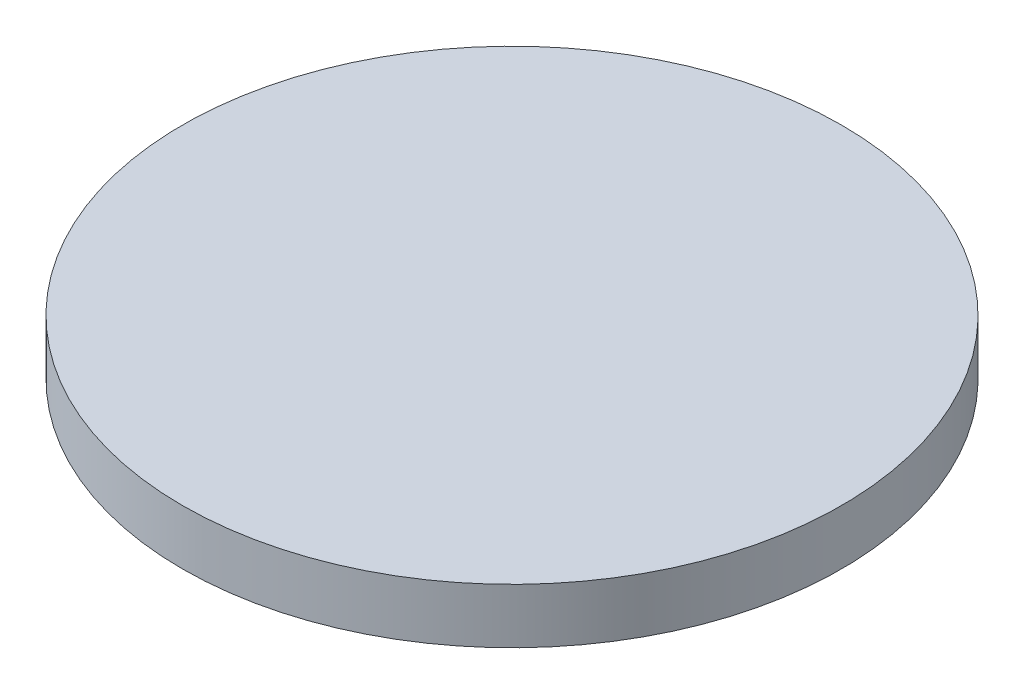
ISO-10303-21;
HEADER;
FILE_DESCRIPTION(('STEP AP214'),'2;1');
FILE_NAME('part.step','',(''),(''),'','','');
FILE_SCHEMA(('AUTOMOTIVE_DESIGN { 1 0 10303 214 1 1 1 1 }'));
ENDSEC;
DATA;
#1=APPLICATION_CONTEXT('core data for automotive mechanical design processes');
#2=APPLICATION_PROTOCOL_DEFINITION('international standard','automotive_design',2000,#1);
#3=PRODUCT_CONTEXT('',#1,'mechanical');
#4=PRODUCT('Part','Part','',(#3));
#5=PRODUCT_RELATED_PRODUCT_CATEGORY('part','',(#4));
#6=PRODUCT_DEFINITION_FORMATION('','',#4);
#7=PRODUCT_DEFINITION_CONTEXT('part definition',#1,'design');
#8=PRODUCT_DEFINITION('design','',#6,#7);
#9=PRODUCT_DEFINITION_SHAPE('','',#8);
#10=(LENGTH_UNIT() NAMED_UNIT(*) SI_UNIT(.MILLI.,.METRE.));
#11=(NAMED_UNIT(*) PLANE_ANGLE_UNIT() SI_UNIT($,.RADIAN.));
#12=(NAMED_UNIT(*) SI_UNIT($,.STERADIAN.) SOLID_ANGLE_UNIT());
#13=UNCERTAINTY_MEASURE_WITH_UNIT(LENGTH_MEASURE(1.E-05),#10,'distance_accuracy_value','');
#14=(GEOMETRIC_REPRESENTATION_CONTEXT(3) GLOBAL_UNCERTAINTY_ASSIGNED_CONTEXT((#13)) GLOBAL_UNIT_ASSIGNED_CONTEXT((#10,
#11,#12)) REPRESENTATION_CONTEXT('',''));
#15=CARTESIAN_POINT('',(0.,0.,0.));
#16=DIRECTION('',(0.,0.,1.));
#17=DIRECTION('',(1.,0.,0.));
#18=AXIS2_PLACEMENT_3D('',#15,#16,#17);
#19=CARTESIAN_POINT('',(0.,500.,0.));
#20=DIRECTION('',(0.,-1.,0.));
#21=DIRECTION('',(0.,0.,-1.));
#22=AXIS2_PLACEMENT_3D('',#19,#20,#21);
#23=CYLINDRICAL_SURFACE('',#22,3000.);
#24=CARTESIAN_POINT('',(0.,500.,0.));
#25=DIRECTION('',(0.,1.,0.));
#26=DIRECTION('',(0.,0.,1.));
#27=AXIS2_PLACEMENT_3D('',#24,#25,#26);
#28=CIRCLE('',#27,3000.);
#29=CARTESIAN_POINT('',(0.,500.,3000.));
#30=VERTEX_POINT('',#29);
#31=EDGE_CURVE('E10',#30,#30,#28,.T.);
#32=ORIENTED_EDGE('',*,*,#31,.F.);
#33=EDGE_LOOP('',(#32));
#34=FACE_BOUND('',#33,.T.);
#35=CARTESIAN_POINT('',(0.,0.,0.));
#36=DIRECTION('',(0.,1.,0.));
#37=DIRECTION('',(0.,0.,1.));
#38=AXIS2_PLACEMENT_3D('',#35,#36,#37);
#39=CIRCLE('',#38,3000.);
#40=CARTESIAN_POINT('',(0.,0.,3000.));
#41=VERTEX_POINT('',#40);
#42=EDGE_CURVE('E34',#41,#41,#39,.T.);
#43=ORIENTED_EDGE('',*,*,#42,.T.);
#44=EDGE_LOOP('',(#43));
#45=FACE_BOUND('',#44,.T.);
#46=ADVANCED_FACE('F31',(#34,#45),#23,.T.);
#47=CARTESIAN_POINT('',(0.,500.,0.));
#48=DIRECTION('',(0.,1.,0.));
#49=DIRECTION('',(0.,0.,1.));
#50=AXIS2_PLACEMENT_3D('',#47,#48,#49);
#51=PLANE('',#50);
#52=ORIENTED_EDGE('',*,*,#31,.T.);
#53=EDGE_LOOP('',(#52));
#54=FACE_BOUND('',#53,.T.);
#55=ADVANCED_FACE('F46',(#54),#51,.T.);
#56=CARTESIAN_POINT('',(0.,0.,0.));
#57=DIRECTION('',(0.,1.,0.));
#58=DIRECTION('',(0.,0.,1.));
#59=AXIS2_PLACEMENT_3D('',#56,#57,#58);
#60=PLANE('',#59);
#61=ORIENTED_EDGE('',*,*,#42,.F.);
#62=EDGE_LOOP('',(#61));
#63=FACE_BOUND('',#62,.T.);
#64=ADVANCED_FACE('F44',(#63),#60,.F.);
#65=CLOSED_SHELL('',(#46,#55,#64));
#66=MANIFOLD_SOLID_BREP('B2',#65);
#67=ADVANCED_BREP_SHAPE_REPRESENTATION('',(#18,#66),#14);
#68=SHAPE_DEFINITION_REPRESENTATION(#9,#67);
ENDSEC;
END-ISO-10303-21;
